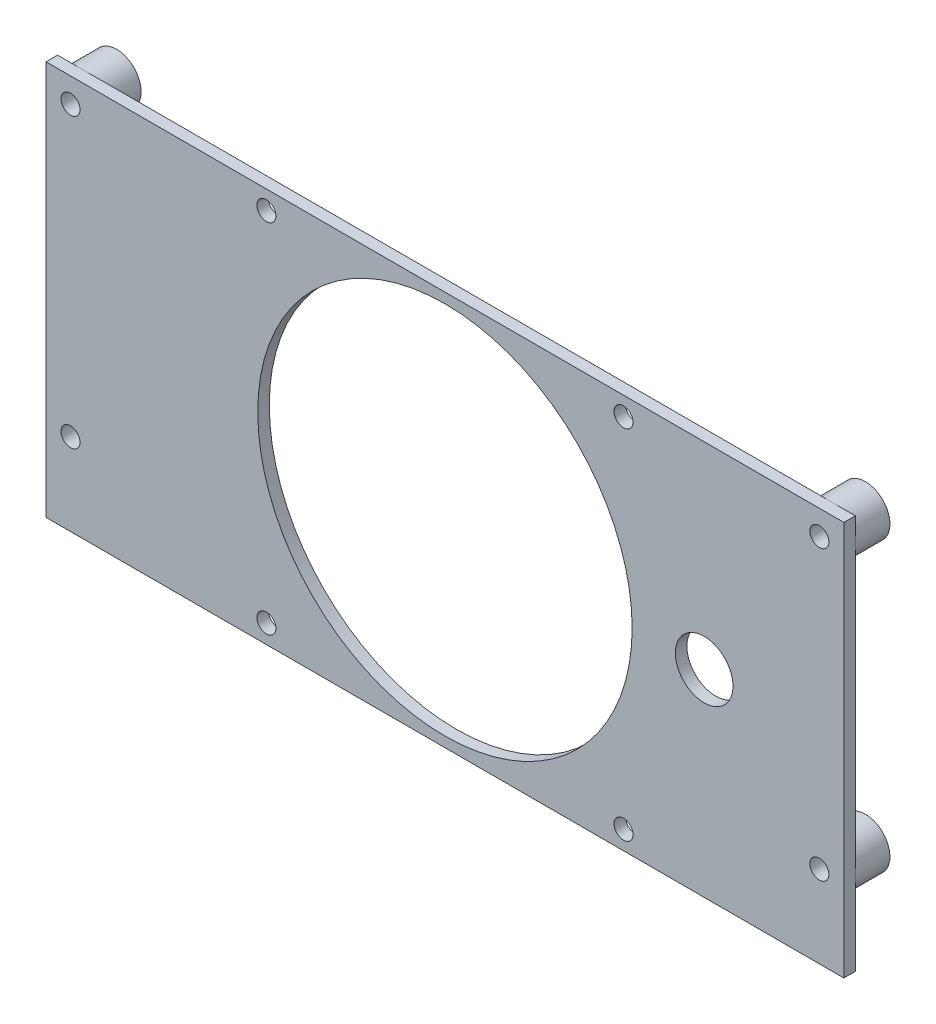
ISO-10303-21;
HEADER;
FILE_DESCRIPTION(('STEP AP214'),'2;1');
FILE_NAME('part.step','',(''),(''),'','','');
FILE_SCHEMA(('AUTOMOTIVE_DESIGN { 1 0 10303 214 1 1 1 1 }'));
ENDSEC;
DATA;
#1=APPLICATION_CONTEXT('core data for automotive mechanical design processes');
#2=APPLICATION_PROTOCOL_DEFINITION('international standard','automotive_design',2000,#1);
#3=PRODUCT_CONTEXT('',#1,'mechanical');
#4=PRODUCT('Part','Part','',(#3));
#5=PRODUCT_RELATED_PRODUCT_CATEGORY('part','',(#4));
#6=PRODUCT_DEFINITION_FORMATION('','',#4);
#7=PRODUCT_DEFINITION_CONTEXT('part definition',#1,'design');
#8=PRODUCT_DEFINITION('design','',#6,#7);
#9=PRODUCT_DEFINITION_SHAPE('','',#8);
#10=(LENGTH_UNIT() NAMED_UNIT(*) SI_UNIT(.MILLI.,.METRE.));
#11=(NAMED_UNIT(*) PLANE_ANGLE_UNIT() SI_UNIT($,.RADIAN.));
#12=(NAMED_UNIT(*) SI_UNIT($,.STERADIAN.) SOLID_ANGLE_UNIT());
#13=UNCERTAINTY_MEASURE_WITH_UNIT(LENGTH_MEASURE(1.E-05),#10,'distance_accuracy_value','');
#14=(GEOMETRIC_REPRESENTATION_CONTEXT(3) GLOBAL_UNCERTAINTY_ASSIGNED_CONTEXT((#13)) GLOBAL_UNIT_ASSIGNED_CONTEXT((#10,
#11,#12)) REPRESENTATION_CONTEXT('',''));
#15=CARTESIAN_POINT('',(0.,0.,0.));
#16=DIRECTION('',(0.,0.,1.));
#17=DIRECTION('',(1.,0.,0.));
#18=AXIS2_PLACEMENT_3D('',#15,#16,#17);
#19=CARTESIAN_POINT('',(0.,0.,0.));
#20=DIRECTION('',(0.,0.,1.));
#21=DIRECTION('',(1.,0.,0.));
#22=AXIS2_PLACEMENT_3D('',#19,#20,#21);
#23=PLANE('',#22);
#24=CARTESIAN_POINT('',(45.,0.,0.));
#25=DIRECTION('',(0.,0.,1.));
#26=DIRECTION('',(1.,0.,0.));
#27=AXIS2_PLACEMENT_3D('',#24,#25,#26);
#28=CIRCLE('',#27,5.);
#29=CARTESIAN_POINT('',(50.,0.,0.));
#30=VERTEX_POINT('',#29);
#31=EDGE_CURVE('E142',#30,#30,#28,.T.);
#32=ORIENTED_EDGE('',*,*,#31,.T.);
#33=EDGE_LOOP('',(#32));
#34=FACE_BOUND('',#33,.T.);
#35=CARTESIAN_POINT('',(31.,31.,0.));
#36=DIRECTION('',(0.,0.,1.));
#37=DIRECTION('',(-1.,0.,0.));
#38=AXIS2_PLACEMENT_3D('',#35,#36,#37);
#39=CIRCLE('',#38,1.65);
#40=CARTESIAN_POINT('',(29.35,31.,0.));
#41=VERTEX_POINT('',#40);
#42=EDGE_CURVE('E148',#41,#41,#39,.T.);
#43=ORIENTED_EDGE('',*,*,#42,.T.);
#44=EDGE_LOOP('',(#43));
#45=FACE_BOUND('',#44,.T.);
#46=CARTESIAN_POINT('',(31.,-31.,0.));
#47=DIRECTION('',(0.,0.,1.));
#48=DIRECTION('',(1.,0.,0.));
#49=AXIS2_PLACEMENT_3D('',#46,#47,#48);
#50=CIRCLE('',#49,1.65);
#51=CARTESIAN_POINT('',(32.65,-31.,0.));
#52=VERTEX_POINT('',#51);
#53=EDGE_CURVE('E154',#52,#52,#50,.T.);
#54=ORIENTED_EDGE('',*,*,#53,.T.);
#55=EDGE_LOOP('',(#54));
#56=FACE_BOUND('',#55,.T.);
#57=CARTESIAN_POINT('',(-31.,-31.,0.));
#58=DIRECTION('',(0.,0.,1.));
#59=DIRECTION('',(-1.,0.,0.));
#60=AXIS2_PLACEMENT_3D('',#57,#58,#59);
#61=CIRCLE('',#60,1.65);
#62=CARTESIAN_POINT('',(-32.65,-31.,0.));
#63=VERTEX_POINT('',#62);
#64=EDGE_CURVE('E160',#63,#63,#61,.T.);
#65=ORIENTED_EDGE('',*,*,#64,.T.);
#66=EDGE_LOOP('',(#65));
#67=FACE_BOUND('',#66,.T.);
#68=CARTESIAN_POINT('',(-31.,31.,0.));
#69=DIRECTION('',(0.,0.,1.));
#70=DIRECTION('',(1.,0.,0.));
#71=AXIS2_PLACEMENT_3D('',#68,#69,#70);
#72=CIRCLE('',#71,1.65);
#73=CARTESIAN_POINT('',(-29.35,31.,0.));
#74=VERTEX_POINT('',#73);
#75=EDGE_CURVE('E166',#74,#74,#72,.T.);
#76=ORIENTED_EDGE('',*,*,#75,.T.);
#77=EDGE_LOOP('',(#76));
#78=FACE_BOUND('',#77,.T.);
#79=CARTESIAN_POINT('',(0.,0.,0.));
#80=DIRECTION('',(0.,0.,1.));
#81=DIRECTION('',(1.,0.,0.));
#82=AXIS2_PLACEMENT_3D('',#79,#80,#81);
#83=CIRCLE('',#82,32.5);
#84=CARTESIAN_POINT('',(32.5,0.,0.));
#85=VERTEX_POINT('',#84);
#86=EDGE_CURVE('E172',#85,#85,#83,.T.);
#87=ORIENTED_EDGE('',*,*,#86,.T.);
#88=EDGE_LOOP('',(#87));
#89=FACE_BOUND('',#88,.T.);
#90=CARTESIAN_POINT('',(65.,30.,0.));
#91=DIRECTION('',(0.,0.,-1.));
#92=DIRECTION('',(1.,0.,0.));
#93=AXIS2_PLACEMENT_3D('',#90,#91,#92);
#94=CIRCLE('',#93,4.25);
#95=CARTESIAN_POINT('',(69.25,30.,0.));
#96=VERTEX_POINT('',#95);
#97=CARTESIAN_POINT('',(65.,34.25,0.));
#98=VERTEX_POINT('',#97);
#99=EDGE_CURVE('E109',#96,#98,#94,.T.);
#100=ORIENTED_EDGE('',*,*,#99,.F.);
#101=DIRECTION('',(0.,1.,0.));
#102=VECTOR('',#101,1.);
#103=CARTESIAN_POINT('',(69.25,34.25,0.));
#104=LINE('',#103,#102);
#105=CARTESIAN_POINT('',(69.25,-20.,0.));
#106=VERTEX_POINT('',#105);
#107=EDGE_CURVE('E94',#106,#96,#104,.T.);
#108=ORIENTED_EDGE('',*,*,#107,.F.);
#109=CARTESIAN_POINT('',(65.,-20.,0.));
#110=DIRECTION('',(0.,0.,-1.));
#111=DIRECTION('',(1.,0.,0.));
#112=AXIS2_PLACEMENT_3D('',#109,#110,#111);
#113=CIRCLE('',#112,4.25);
#114=EDGE_CURVE('E122',#106,#106,#113,.T.);
#115=ORIENTED_EDGE('',*,*,#114,.F.);
#116=CARTESIAN_POINT('',(69.25,-34.25,0.));
#117=VERTEX_POINT('',#116);
#118=EDGE_CURVE('E99',#117,#106,#104,.T.);
#119=ORIENTED_EDGE('',*,*,#118,.F.);
#120=DIRECTION('',(1.,0.,0.));
#121=VECTOR('',#120,1.);
#122=CARTESIAN_POINT('',(-69.25,-34.25,0.));
#123=LINE('',#122,#121);
#124=CARTESIAN_POINT('',(-69.25,-34.25,0.));
#125=VERTEX_POINT('',#124);
#126=EDGE_CURVE('E195',#125,#117,#123,.T.);
#127=ORIENTED_EDGE('',*,*,#126,.F.);
#128=DIRECTION('',(0.,-1.,0.));
#129=VECTOR('',#128,1.);
#130=CARTESIAN_POINT('',(-69.25,34.25,0.));
#131=LINE('',#130,#129);
#132=CARTESIAN_POINT('',(-69.25,-20.,0.));
#133=VERTEX_POINT('',#132);
#134=EDGE_CURVE('E204',#133,#125,#131,.T.);
#135=ORIENTED_EDGE('',*,*,#134,.F.);
#136=CARTESIAN_POINT('',(-65.,-20.,0.));
#137=DIRECTION('',(0.,0.,-1.));
#138=DIRECTION('',(-1.,0.,0.));
#139=AXIS2_PLACEMENT_3D('',#136,#137,#138);
#140=CIRCLE('',#139,4.25);
#141=EDGE_CURVE('E131',#133,#133,#140,.T.);
#142=ORIENTED_EDGE('',*,*,#141,.F.);
#143=CARTESIAN_POINT('',(-69.25,30.,0.));
#144=VERTEX_POINT('',#143);
#145=EDGE_CURVE('E207',#144,#133,#131,.T.);
#146=ORIENTED_EDGE('',*,*,#145,.F.);
#147=CARTESIAN_POINT('',(-65.,30.,0.));
#148=DIRECTION('',(0.,0.,-1.));
#149=DIRECTION('',(-1.,0.,0.));
#150=AXIS2_PLACEMENT_3D('',#147,#148,#149);
#151=CIRCLE('',#150,4.25);
#152=CARTESIAN_POINT('',(-65.,34.25,0.));
#153=VERTEX_POINT('',#152);
#154=EDGE_CURVE('E11',#153,#144,#151,.T.);
#155=ORIENTED_EDGE('',*,*,#154,.F.);
#156=DIRECTION('',(-1.,0.,0.));
#157=VECTOR('',#156,1.);
#158=CARTESIAN_POINT('',(-69.25,34.25,0.));
#159=LINE('',#158,#157);
#160=EDGE_CURVE('E56',#98,#153,#159,.T.);
#161=ORIENTED_EDGE('',*,*,#160,.F.);
#162=EDGE_LOOP('',(#100,#108,#115,#119,#127,#135,#142,#146,#155,#161));
#163=FACE_BOUND('',#162,.T.);
#164=ADVANCED_FACE('F32',(#34,#45,#56,#67,#78,#89,#163),#23,.F.);
#165=EDGE_CURVE('E49',#98,#96,#94,.T.);
#166=ORIENTED_EDGE('',*,*,#165,.F.);
#167=CARTESIAN_POINT('',(69.25,34.25,0.));
#168=VERTEX_POINT('',#167);
#169=EDGE_CURVE('E105',#168,#98,#159,.T.);
#170=ORIENTED_EDGE('',*,*,#169,.F.);
#171=EDGE_CURVE('E96',#96,#168,#104,.T.);
#172=ORIENTED_EDGE('',*,*,#171,.F.);
#173=EDGE_LOOP('',(#166,#170,#172));
#174=FACE_BOUND('',#173,.T.);
#175=ADVANCED_FACE('F104',(#174),#23,.F.);
#176=EDGE_CURVE('E42',#144,#153,#151,.T.);
#177=ORIENTED_EDGE('',*,*,#176,.F.);
#178=CARTESIAN_POINT('',(-69.25,34.25,0.));
#179=VERTEX_POINT('',#178);
#180=EDGE_CURVE('E205',#179,#144,#131,.T.);
#181=ORIENTED_EDGE('',*,*,#180,.F.);
#182=EDGE_CURVE('E202',#153,#179,#159,.T.);
#183=ORIENTED_EDGE('',*,*,#182,.F.);
#184=EDGE_LOOP('',(#177,#181,#183));
#185=FACE_BOUND('',#184,.T.);
#186=ADVANCED_FACE('F252',(#185),#23,.F.);
#187=CARTESIAN_POINT('',(0.,0.,2.));
#188=DIRECTION('',(0.,0.,1.));
#189=DIRECTION('',(1.,0.,0.));
#190=AXIS2_PLACEMENT_3D('',#187,#188,#189);
#191=PLANE('',#190);
#192=CARTESIAN_POINT('',(31.,31.,2.));
#193=DIRECTION('',(0.,0.,1.));
#194=DIRECTION('',(-1.,0.,0.));
#195=AXIS2_PLACEMENT_3D('',#192,#193,#194);
#196=CIRCLE('',#195,1.65);
#197=CARTESIAN_POINT('',(29.35,31.,2.));
#198=VERTEX_POINT('',#197);
#199=EDGE_CURVE('E151',#198,#198,#196,.T.);
#200=ORIENTED_EDGE('',*,*,#199,.F.);
#201=EDGE_LOOP('',(#200));
#202=FACE_BOUND('',#201,.T.);
#203=CARTESIAN_POINT('',(-31.,-31.,2.));
#204=DIRECTION('',(0.,0.,1.));
#205=DIRECTION('',(-1.,0.,0.));
#206=AXIS2_PLACEMENT_3D('',#203,#204,#205);
#207=CIRCLE('',#206,1.65);
#208=CARTESIAN_POINT('',(-32.65,-31.,2.));
#209=VERTEX_POINT('',#208);
#210=EDGE_CURVE('E163',#209,#209,#207,.T.);
#211=ORIENTED_EDGE('',*,*,#210,.F.);
#212=EDGE_LOOP('',(#211));
#213=FACE_BOUND('',#212,.T.);
#214=CARTESIAN_POINT('',(0.,0.,2.));
#215=DIRECTION('',(0.,0.,1.));
#216=DIRECTION('',(1.,0.,0.));
#217=AXIS2_PLACEMENT_3D('',#214,#215,#216);
#218=CIRCLE('',#217,32.5);
#219=CARTESIAN_POINT('',(32.5,0.,2.));
#220=VERTEX_POINT('',#219);
#221=EDGE_CURVE('E175',#220,#220,#218,.T.);
#222=ORIENTED_EDGE('',*,*,#221,.F.);
#223=EDGE_LOOP('',(#222));
#224=FACE_BOUND('',#223,.T.);
#225=CARTESIAN_POINT('',(65.,-20.,2.));
#226=DIRECTION('',(0.,0.,1.));
#227=DIRECTION('',(-1.,0.,0.));
#228=AXIS2_PLACEMENT_3D('',#225,#226,#227);
#229=CIRCLE('',#228,1.65);
#230=CARTESIAN_POINT('',(63.35,-20.,2.));
#231=VERTEX_POINT('',#230);
#232=EDGE_CURVE('E183',#231,#231,#229,.T.);
#233=ORIENTED_EDGE('',*,*,#232,.F.);
#234=EDGE_LOOP('',(#233));
#235=FACE_BOUND('',#234,.T.);
#236=CARTESIAN_POINT('',(-65.,30.,2.));
#237=DIRECTION('',(0.,0.,1.));
#238=DIRECTION('',(1.,0.,0.));
#239=AXIS2_PLACEMENT_3D('',#236,#237,#238);
#240=CIRCLE('',#239,1.65);
#241=CARTESIAN_POINT('',(-63.35,30.,2.));
#242=VERTEX_POINT('',#241);
#243=EDGE_CURVE('E107',#242,#242,#240,.T.);
#244=ORIENTED_EDGE('',*,*,#243,.F.);
#245=EDGE_LOOP('',(#244));
#246=FACE_BOUND('',#245,.T.);
#247=DIRECTION('',(0.,1.,0.));
#248=VECTOR('',#247,1.);
#249=CARTESIAN_POINT('',(69.25,34.25,2.));
#250=LINE('',#249,#248);
#251=CARTESIAN_POINT('',(69.25,-34.25,2.));
#252=VERTEX_POINT('',#251);
#253=CARTESIAN_POINT('',(69.25,34.25,2.));
#254=VERTEX_POINT('',#253);
#255=EDGE_CURVE('E191',#252,#254,#250,.T.);
#256=ORIENTED_EDGE('',*,*,#255,.T.);
#257=DIRECTION('',(-1.,0.,0.));
#258=VECTOR('',#257,1.);
#259=CARTESIAN_POINT('',(-69.25,34.25,2.));
#260=LINE('',#259,#258);
#261=CARTESIAN_POINT('',(-69.25,34.25,2.));
#262=VERTEX_POINT('',#261);
#263=EDGE_CURVE('E194',#254,#262,#260,.T.);
#264=ORIENTED_EDGE('',*,*,#263,.T.);
#265=DIRECTION('',(0.,-1.,0.));
#266=VECTOR('',#265,1.);
#267=CARTESIAN_POINT('',(-69.25,34.25,2.));
#268=LINE('',#267,#266);
#269=CARTESIAN_POINT('',(-69.25,-34.25,2.));
#270=VERTEX_POINT('',#269);
#271=EDGE_CURVE('E197',#262,#270,#268,.T.);
#272=ORIENTED_EDGE('',*,*,#271,.T.);
#273=DIRECTION('',(1.,0.,0.));
#274=VECTOR('',#273,1.);
#275=CARTESIAN_POINT('',(-69.25,-34.25,2.));
#276=LINE('',#275,#274);
#277=EDGE_CURVE('E199',#270,#252,#276,.T.);
#278=ORIENTED_EDGE('',*,*,#277,.T.);
#279=EDGE_LOOP('',(#256,#264,#272,#278));
#280=FACE_BOUND('',#279,.T.);
#281=CARTESIAN_POINT('',(-65.,-20.,2.));
#282=DIRECTION('',(0.,0.,1.));
#283=DIRECTION('',(1.,0.,0.));
#284=AXIS2_PLACEMENT_3D('',#281,#282,#283);
#285=CIRCLE('',#284,1.65);
#286=CARTESIAN_POINT('',(-63.35,-20.,2.));
#287=VERTEX_POINT('',#286);
#288=EDGE_CURVE('E186',#287,#287,#285,.T.);
#289=ORIENTED_EDGE('',*,*,#288,.F.);
#290=EDGE_LOOP('',(#289));
#291=FACE_BOUND('',#290,.T.);
#292=CARTESIAN_POINT('',(65.,30.,2.));
#293=DIRECTION('',(0.,0.,1.));
#294=DIRECTION('',(-1.,0.,0.));
#295=AXIS2_PLACEMENT_3D('',#292,#293,#294);
#296=CIRCLE('',#295,1.65);
#297=CARTESIAN_POINT('',(63.35,30.,2.));
#298=VERTEX_POINT('',#297);
#299=EDGE_CURVE('E178',#298,#298,#296,.T.);
#300=ORIENTED_EDGE('',*,*,#299,.F.);
#301=EDGE_LOOP('',(#300));
#302=FACE_BOUND('',#301,.T.);
#303=CARTESIAN_POINT('',(-31.,31.,2.));
#304=DIRECTION('',(0.,0.,1.));
#305=DIRECTION('',(1.,0.,0.));
#306=AXIS2_PLACEMENT_3D('',#303,#304,#305);
#307=CIRCLE('',#306,1.65);
#308=CARTESIAN_POINT('',(-29.35,31.,2.));
#309=VERTEX_POINT('',#308);
#310=EDGE_CURVE('E169',#309,#309,#307,.T.);
#311=ORIENTED_EDGE('',*,*,#310,.F.);
#312=EDGE_LOOP('',(#311));
#313=FACE_BOUND('',#312,.T.);
#314=CARTESIAN_POINT('',(31.,-31.,2.));
#315=DIRECTION('',(0.,0.,1.));
#316=DIRECTION('',(1.,0.,0.));
#317=AXIS2_PLACEMENT_3D('',#314,#315,#316);
#318=CIRCLE('',#317,1.65);
#319=CARTESIAN_POINT('',(32.65,-31.,2.));
#320=VERTEX_POINT('',#319);
#321=EDGE_CURVE('E157',#320,#320,#318,.T.);
#322=ORIENTED_EDGE('',*,*,#321,.F.);
#323=EDGE_LOOP('',(#322));
#324=FACE_BOUND('',#323,.T.);
#325=CARTESIAN_POINT('',(45.,0.,2.));
#326=DIRECTION('',(0.,0.,1.));
#327=DIRECTION('',(1.,0.,0.));
#328=AXIS2_PLACEMENT_3D('',#325,#326,#327);
#329=CIRCLE('',#328,5.);
#330=CARTESIAN_POINT('',(50.,0.,2.));
#331=VERTEX_POINT('',#330);
#332=EDGE_CURVE('E145',#331,#331,#329,.T.);
#333=ORIENTED_EDGE('',*,*,#332,.F.);
#334=EDGE_LOOP('',(#333));
#335=FACE_BOUND('',#334,.T.);
#336=ADVANCED_FACE('F222',(#202,#213,#224,#235,#246,#280,#291,#302,#313,#324,#335),#191,.T.);
#337=CARTESIAN_POINT('',(69.25,34.25,2.));
#338=DIRECTION('',(-1.,0.,0.));
#339=DIRECTION('',(0.,0.,1.));
#340=AXIS2_PLACEMENT_3D('',#337,#338,#339);
#341=PLANE('',#340);
#342=ORIENTED_EDGE('',*,*,#118,.T.);
#343=ORIENTED_EDGE('',*,*,#107,.T.);
#344=ORIENTED_EDGE('',*,*,#171,.T.);
#345=DIRECTION('',(0.,0.,-1.));
#346=VECTOR('',#345,1.);
#347=CARTESIAN_POINT('',(69.25,34.25,2.));
#348=LINE('',#347,#346);
#349=EDGE_CURVE('E36',#254,#168,#348,.T.);
#350=ORIENTED_EDGE('',*,*,#349,.F.);
#351=ORIENTED_EDGE('',*,*,#255,.F.);
#352=DIRECTION('',(0.,0.,-1.));
#353=VECTOR('',#352,1.);
#354=CARTESIAN_POINT('',(69.25,-34.25,2.));
#355=LINE('',#354,#353);
#356=EDGE_CURVE('E200',#252,#117,#355,.T.);
#357=ORIENTED_EDGE('',*,*,#356,.T.);
#358=EDGE_LOOP('',(#342,#343,#344,#350,#351,#357));
#359=FACE_BOUND('',#358,.T.);
#360=ADVANCED_FACE('F34',(#359),#341,.F.);
#361=CARTESIAN_POINT('',(-69.25,34.25,2.));
#362=DIRECTION('',(0.,-1.,0.));
#363=DIRECTION('',(0.,0.,-1.));
#364=AXIS2_PLACEMENT_3D('',#361,#362,#363);
#365=PLANE('',#364);
#366=ORIENTED_EDGE('',*,*,#169,.T.);
#367=ORIENTED_EDGE('',*,*,#160,.T.);
#368=ORIENTED_EDGE('',*,*,#182,.T.);
#369=DIRECTION('',(0.,0.,-1.));
#370=VECTOR('',#369,1.);
#371=CARTESIAN_POINT('',(-69.25,34.25,2.));
#372=LINE('',#371,#370);
#373=EDGE_CURVE('E212',#262,#179,#372,.T.);
#374=ORIENTED_EDGE('',*,*,#373,.F.);
#375=ORIENTED_EDGE('',*,*,#263,.F.);
#376=ORIENTED_EDGE('',*,*,#349,.T.);
#377=EDGE_LOOP('',(#366,#367,#368,#374,#375,#376));
#378=FACE_BOUND('',#377,.T.);
#379=ADVANCED_FACE('F218',(#378),#365,.F.);
#380=CARTESIAN_POINT('',(-69.25,34.25,2.));
#381=DIRECTION('',(1.,0.,0.));
#382=DIRECTION('',(0.,1.,0.));
#383=AXIS2_PLACEMENT_3D('',#380,#381,#382);
#384=PLANE('',#383);
#385=ORIENTED_EDGE('',*,*,#180,.T.);
#386=ORIENTED_EDGE('',*,*,#145,.T.);
#387=ORIENTED_EDGE('',*,*,#134,.T.);
#388=DIRECTION('',(0.,0.,-1.));
#389=VECTOR('',#388,1.);
#390=CARTESIAN_POINT('',(-69.25,-34.25,2.));
#391=LINE('',#390,#389);
#392=EDGE_CURVE('E210',#270,#125,#391,.T.);
#393=ORIENTED_EDGE('',*,*,#392,.F.);
#394=ORIENTED_EDGE('',*,*,#271,.F.);
#395=ORIENTED_EDGE('',*,*,#373,.T.);
#396=EDGE_LOOP('',(#385,#386,#387,#393,#394,#395));
#397=FACE_BOUND('',#396,.T.);
#398=ADVANCED_FACE('F270',(#397),#384,.F.);
#399=CARTESIAN_POINT('',(-69.25,-34.25,2.));
#400=DIRECTION('',(0.,1.,0.));
#401=DIRECTION('',(0.,0.,1.));
#402=AXIS2_PLACEMENT_3D('',#399,#400,#401);
#403=PLANE('',#402);
#404=ORIENTED_EDGE('',*,*,#126,.T.);
#405=ORIENTED_EDGE('',*,*,#356,.F.);
#406=ORIENTED_EDGE('',*,*,#277,.F.);
#407=ORIENTED_EDGE('',*,*,#392,.T.);
#408=EDGE_LOOP('',(#404,#405,#406,#407));
#409=FACE_BOUND('',#408,.T.);
#410=ADVANCED_FACE('F227',(#409),#403,.F.);
#411=CARTESIAN_POINT('',(-65.,30.,2.));
#412=DIRECTION('',(0.,0.,-1.));
#413=DIRECTION('',(-1.,0.,0.));
#414=AXIS2_PLACEMENT_3D('',#411,#412,#413);
#415=CYLINDRICAL_SURFACE('',#414,1.65);
#416=ORIENTED_EDGE('',*,*,#243,.T.);
#417=EDGE_LOOP('',(#416));
#418=FACE_BOUND('',#417,.T.);
#419=CARTESIAN_POINT('',(-65.,30.,-6.));
#420=DIRECTION('',(0.,0.,-1.));
#421=DIRECTION('',(-1.,0.,0.));
#422=AXIS2_PLACEMENT_3D('',#419,#420,#421);
#423=CIRCLE('',#422,1.65);
#424=CARTESIAN_POINT('',(-66.65,30.,-6.));
#425=VERTEX_POINT('',#424);
#426=EDGE_CURVE('E135',#425,#425,#423,.T.);
#427=ORIENTED_EDGE('',*,*,#426,.T.);
#428=EDGE_LOOP('',(#427));
#429=FACE_BOUND('',#428,.T.);
#430=ADVANCED_FACE('F277',(#418,#429),#415,.F.);
#431=CARTESIAN_POINT('',(-65.,-20.,2.));
#432=DIRECTION('',(0.,0.,-1.));
#433=DIRECTION('',(-1.,0.,0.));
#434=AXIS2_PLACEMENT_3D('',#431,#432,#433);
#435=CYLINDRICAL_SURFACE('',#434,1.65);
#436=ORIENTED_EDGE('',*,*,#288,.T.);
#437=EDGE_LOOP('',(#436));
#438=FACE_BOUND('',#437,.T.);
#439=CARTESIAN_POINT('',(-65.,-20.,-6.));
#440=DIRECTION('',(0.,0.,-1.));
#441=DIRECTION('',(-1.,0.,0.));
#442=AXIS2_PLACEMENT_3D('',#439,#440,#441);
#443=CIRCLE('',#442,1.65);
#444=CARTESIAN_POINT('',(-66.65,-20.,-6.));
#445=VERTEX_POINT('',#444);
#446=EDGE_CURVE('E126',#445,#445,#443,.T.);
#447=ORIENTED_EDGE('',*,*,#446,.T.);
#448=EDGE_LOOP('',(#447));
#449=FACE_BOUND('',#448,.T.);
#450=ADVANCED_FACE('F384',(#438,#449),#435,.F.);
#451=CARTESIAN_POINT('',(65.,-20.,2.));
#452=DIRECTION('',(0.,0.,-1.));
#453=DIRECTION('',(-1.,0.,0.));
#454=AXIS2_PLACEMENT_3D('',#451,#452,#453);
#455=CYLINDRICAL_SURFACE('',#454,1.65);
#456=ORIENTED_EDGE('',*,*,#232,.T.);
#457=EDGE_LOOP('',(#456));
#458=FACE_BOUND('',#457,.T.);
#459=CARTESIAN_POINT('',(65.,-20.,-6.));
#460=DIRECTION('',(0.,0.,-1.));
#461=DIRECTION('',(1.,0.,0.));
#462=AXIS2_PLACEMENT_3D('',#459,#460,#461);
#463=CIRCLE('',#462,1.65);
#464=CARTESIAN_POINT('',(66.65,-20.,-6.));
#465=VERTEX_POINT('',#464);
#466=EDGE_CURVE('E119',#465,#465,#463,.T.);
#467=ORIENTED_EDGE('',*,*,#466,.T.);
#468=EDGE_LOOP('',(#467));
#469=FACE_BOUND('',#468,.T.);
#470=ADVANCED_FACE('F396',(#458,#469),#455,.F.);
#471=CARTESIAN_POINT('',(65.,30.,2.));
#472=DIRECTION('',(0.,0.,-1.));
#473=DIRECTION('',(-1.,0.,0.));
#474=AXIS2_PLACEMENT_3D('',#471,#472,#473);
#475=CYLINDRICAL_SURFACE('',#474,1.65);
#476=ORIENTED_EDGE('',*,*,#299,.T.);
#477=EDGE_LOOP('',(#476));
#478=FACE_BOUND('',#477,.T.);
#479=CARTESIAN_POINT('',(65.,30.,-6.));
#480=DIRECTION('',(0.,0.,-1.));
#481=DIRECTION('',(1.,0.,0.));
#482=AXIS2_PLACEMENT_3D('',#479,#480,#481);
#483=CIRCLE('',#482,1.65);
#484=CARTESIAN_POINT('',(66.65,30.,-6.));
#485=VERTEX_POINT('',#484);
#486=EDGE_CURVE('E114',#485,#485,#483,.T.);
#487=ORIENTED_EDGE('',*,*,#486,.T.);
#488=EDGE_LOOP('',(#487));
#489=FACE_BOUND('',#488,.T.);
#490=ADVANCED_FACE('F307',(#478,#489),#475,.F.);
#491=CARTESIAN_POINT('',(0.,0.,2.));
#492=DIRECTION('',(0.,0.,-1.));
#493=DIRECTION('',(-1.,0.,0.));
#494=AXIS2_PLACEMENT_3D('',#491,#492,#493);
#495=CYLINDRICAL_SURFACE('',#494,32.5);
#496=ORIENTED_EDGE('',*,*,#221,.T.);
#497=EDGE_LOOP('',(#496));
#498=FACE_BOUND('',#497,.T.);
#499=ORIENTED_EDGE('',*,*,#86,.F.);
#500=EDGE_LOOP('',(#499));
#501=FACE_BOUND('',#500,.T.);
#502=ADVANCED_FACE('F301',(#498,#501),#495,.F.);
#503=CARTESIAN_POINT('',(-31.,31.,2.));
#504=DIRECTION('',(0.,0.,-1.));
#505=DIRECTION('',(-1.,0.,0.));
#506=AXIS2_PLACEMENT_3D('',#503,#504,#505);
#507=CYLINDRICAL_SURFACE('',#506,1.65);
#508=ORIENTED_EDGE('',*,*,#310,.T.);
#509=EDGE_LOOP('',(#508));
#510=FACE_BOUND('',#509,.T.);
#511=ORIENTED_EDGE('',*,*,#75,.F.);
#512=EDGE_LOOP('',(#511));
#513=FACE_BOUND('',#512,.T.);
#514=ADVANCED_FACE('F306',(#510,#513),#507,.F.);
#515=CARTESIAN_POINT('',(-31.,-31.,2.));
#516=DIRECTION('',(0.,0.,-1.));
#517=DIRECTION('',(-1.,0.,0.));
#518=AXIS2_PLACEMENT_3D('',#515,#516,#517);
#519=CYLINDRICAL_SURFACE('',#518,1.65);
#520=ORIENTED_EDGE('',*,*,#210,.T.);
#521=EDGE_LOOP('',(#520));
#522=FACE_BOUND('',#521,.T.);
#523=ORIENTED_EDGE('',*,*,#64,.F.);
#524=EDGE_LOOP('',(#523));
#525=FACE_BOUND('',#524,.T.);
#526=ADVANCED_FACE('F319',(#522,#525),#519,.F.);
#527=CARTESIAN_POINT('',(31.,-31.,2.));
#528=DIRECTION('',(0.,0.,-1.));
#529=DIRECTION('',(-1.,0.,0.));
#530=AXIS2_PLACEMENT_3D('',#527,#528,#529);
#531=CYLINDRICAL_SURFACE('',#530,1.65);
#532=ORIENTED_EDGE('',*,*,#321,.T.);
#533=EDGE_LOOP('',(#532));
#534=FACE_BOUND('',#533,.T.);
#535=ORIENTED_EDGE('',*,*,#53,.F.);
#536=EDGE_LOOP('',(#535));
#537=FACE_BOUND('',#536,.T.);
#538=ADVANCED_FACE('F329',(#534,#537),#531,.F.);
#539=CARTESIAN_POINT('',(31.,31.,2.));
#540=DIRECTION('',(0.,0.,-1.));
#541=DIRECTION('',(-1.,0.,0.));
#542=AXIS2_PLACEMENT_3D('',#539,#540,#541);
#543=CYLINDRICAL_SURFACE('',#542,1.65);
#544=ORIENTED_EDGE('',*,*,#199,.T.);
#545=EDGE_LOOP('',(#544));
#546=FACE_BOUND('',#545,.T.);
#547=ORIENTED_EDGE('',*,*,#42,.F.);
#548=EDGE_LOOP('',(#547));
#549=FACE_BOUND('',#548,.T.);
#550=ADVANCED_FACE('F339',(#546,#549),#543,.F.);
#551=CARTESIAN_POINT('',(45.,0.,2.));
#552=DIRECTION('',(0.,0.,-1.));
#553=DIRECTION('',(-1.,0.,0.));
#554=AXIS2_PLACEMENT_3D('',#551,#552,#553);
#555=CYLINDRICAL_SURFACE('',#554,5.);
#556=ORIENTED_EDGE('',*,*,#332,.T.);
#557=EDGE_LOOP('',(#556));
#558=FACE_BOUND('',#557,.T.);
#559=ORIENTED_EDGE('',*,*,#31,.F.);
#560=EDGE_LOOP('',(#559));
#561=FACE_BOUND('',#560,.T.);
#562=ADVANCED_FACE('F349',(#558,#561),#555,.F.);
#563=CARTESIAN_POINT('',(-65.,30.,-6.));
#564=DIRECTION('',(0.,0.,-1.));
#565=DIRECTION('',(-1.,0.,0.));
#566=AXIS2_PLACEMENT_3D('',#563,#564,#565);
#567=PLANE('',#566);
#568=CARTESIAN_POINT('',(-65.,30.,-6.));
#569=DIRECTION('',(0.,0.,-1.));
#570=DIRECTION('',(-1.,0.,0.));
#571=AXIS2_PLACEMENT_3D('',#568,#569,#570);
#572=CIRCLE('',#571,4.25);
#573=CARTESIAN_POINT('',(-69.25,30.,-6.));
#574=VERTEX_POINT('',#573);
#575=EDGE_CURVE('E140',#574,#574,#572,.T.);
#576=ORIENTED_EDGE('',*,*,#575,.T.);
#577=EDGE_LOOP('',(#576));
#578=FACE_BOUND('',#577,.T.);
#579=ORIENTED_EDGE('',*,*,#426,.F.);
#580=EDGE_LOOP('',(#579));
#581=FACE_BOUND('',#580,.T.);
#582=ADVANCED_FACE('F358',(#578,#581),#567,.T.);
#583=CARTESIAN_POINT('',(-65.,30.,-6.));
#584=DIRECTION('',(0.,0.,1.));
#585=DIRECTION('',(1.,0.,0.));
#586=AXIS2_PLACEMENT_3D('',#583,#584,#585);
#587=CYLINDRICAL_SURFACE('',#586,4.25);
#588=ORIENTED_EDGE('',*,*,#575,.F.);
#589=EDGE_LOOP('',(#588));
#590=FACE_BOUND('',#589,.T.);
#591=ORIENTED_EDGE('',*,*,#176,.T.);
#592=ORIENTED_EDGE('',*,*,#154,.T.);
#593=EDGE_LOOP('',(#591,#592));
#594=FACE_BOUND('',#593,.T.);
#595=ADVANCED_FACE('F268',(#590,#594),#587,.T.);
#596=CARTESIAN_POINT('',(-65.,-20.,-6.));
#597=DIRECTION('',(0.,0.,-1.));
#598=DIRECTION('',(-1.,0.,0.));
#599=AXIS2_PLACEMENT_3D('',#596,#597,#598);
#600=PLANE('',#599);
#601=CARTESIAN_POINT('',(-65.,-20.,-6.));
#602=DIRECTION('',(0.,0.,-1.));
#603=DIRECTION('',(-1.,0.,0.));
#604=AXIS2_PLACEMENT_3D('',#601,#602,#603);
#605=CIRCLE('',#604,4.25);
#606=CARTESIAN_POINT('',(-69.25,-20.,-6.));
#607=VERTEX_POINT('',#606);
#608=EDGE_CURVE('E132',#607,#607,#605,.T.);
#609=ORIENTED_EDGE('',*,*,#608,.T.);
#610=EDGE_LOOP('',(#609));
#611=FACE_BOUND('',#610,.T.);
#612=ORIENTED_EDGE('',*,*,#446,.F.);
#613=EDGE_LOOP('',(#612));
#614=FACE_BOUND('',#613,.T.);
#615=ADVANCED_FACE('F434',(#611,#614),#600,.T.);
#616=CARTESIAN_POINT('',(-65.,-20.,-6.));
#617=DIRECTION('',(0.,0.,1.));
#618=DIRECTION('',(1.,0.,0.));
#619=AXIS2_PLACEMENT_3D('',#616,#617,#618);
#620=CYLINDRICAL_SURFACE('',#619,4.25);
#621=ORIENTED_EDGE('',*,*,#608,.F.);
#622=EDGE_LOOP('',(#621));
#623=FACE_BOUND('',#622,.T.);
#624=ORIENTED_EDGE('',*,*,#141,.T.);
#625=EDGE_LOOP('',(#624));
#626=FACE_BOUND('',#625,.T.);
#627=ADVANCED_FACE('F244',(#623,#626),#620,.T.);
#628=CARTESIAN_POINT('',(65.,-20.,-6.));
#629=DIRECTION('',(0.,0.,1.));
#630=DIRECTION('',(1.,0.,0.));
#631=AXIS2_PLACEMENT_3D('',#628,#629,#630);
#632=PLANE('',#631);
#633=CARTESIAN_POINT('',(65.,-20.,-6.));
#634=DIRECTION('',(0.,0.,-1.));
#635=DIRECTION('',(1.,0.,0.));
#636=AXIS2_PLACEMENT_3D('',#633,#634,#635);
#637=CIRCLE('',#636,4.25);
#638=CARTESIAN_POINT('',(69.25,-20.,-6.));
#639=VERTEX_POINT('',#638);
#640=EDGE_CURVE('E123',#639,#639,#637,.T.);
#641=ORIENTED_EDGE('',*,*,#640,.T.);
#642=EDGE_LOOP('',(#641));
#643=FACE_BOUND('',#642,.T.);
#644=ORIENTED_EDGE('',*,*,#466,.F.);
#645=EDGE_LOOP('',(#644));
#646=FACE_BOUND('',#645,.T.);
#647=ADVANCED_FACE('F235',(#643,#646),#632,.F.);
#648=CARTESIAN_POINT('',(65.,-20.,-6.));
#649=DIRECTION('',(0.,0.,1.));
#650=DIRECTION('',(1.,0.,0.));
#651=AXIS2_PLACEMENT_3D('',#648,#649,#650);
#652=CYLINDRICAL_SURFACE('',#651,4.25);
#653=ORIENTED_EDGE('',*,*,#640,.F.);
#654=EDGE_LOOP('',(#653));
#655=FACE_BOUND('',#654,.T.);
#656=ORIENTED_EDGE('',*,*,#114,.T.);
#657=EDGE_LOOP('',(#656));
#658=FACE_BOUND('',#657,.T.);
#659=ADVANCED_FACE('F232',(#655,#658),#652,.T.);
#660=CARTESIAN_POINT('',(65.,30.,-6.));
#661=DIRECTION('',(0.,0.,1.));
#662=DIRECTION('',(1.,0.,0.));
#663=AXIS2_PLACEMENT_3D('',#660,#661,#662);
#664=PLANE('',#663);
#665=CARTESIAN_POINT('',(65.,30.,-6.));
#666=DIRECTION('',(0.,0.,-1.));
#667=DIRECTION('',(1.,0.,0.));
#668=AXIS2_PLACEMENT_3D('',#665,#666,#667);
#669=CIRCLE('',#668,4.25);
#670=CARTESIAN_POINT('',(69.25,30.,-6.));
#671=VERTEX_POINT('',#670);
#672=EDGE_CURVE('E111',#671,#671,#669,.T.);
#673=ORIENTED_EDGE('',*,*,#672,.T.);
#674=EDGE_LOOP('',(#673));
#675=FACE_BOUND('',#674,.T.);
#676=ORIENTED_EDGE('',*,*,#486,.F.);
#677=EDGE_LOOP('',(#676));
#678=FACE_BOUND('',#677,.T.);
#679=ADVANCED_FACE('F234',(#675,#678),#664,.F.);
#680=CARTESIAN_POINT('',(65.,30.,-6.));
#681=DIRECTION('',(0.,0.,1.));
#682=DIRECTION('',(1.,0.,0.));
#683=AXIS2_PLACEMENT_3D('',#680,#681,#682);
#684=CYLINDRICAL_SURFACE('',#683,4.25);
#685=ORIENTED_EDGE('',*,*,#672,.F.);
#686=EDGE_LOOP('',(#685));
#687=FACE_BOUND('',#686,.T.);
#688=ORIENTED_EDGE('',*,*,#99,.T.);
#689=ORIENTED_EDGE('',*,*,#165,.T.);
#690=EDGE_LOOP('',(#688,#689));
#691=FACE_BOUND('',#690,.T.);
#692=ADVANCED_FACE('F113',(#687,#691),#684,.T.);
#693=CLOSED_SHELL('',(#164,#175,#186,#336,#360,#379,#398,#410,#430,#450,#470,#490,#502,#514,
#526,#538,#550,#562,#582,#595,#615,#627,#647,#659,#679,#692));
#694=MANIFOLD_SOLID_BREP('B2',#693);
#695=ADVANCED_BREP_SHAPE_REPRESENTATION('',(#18,#694),#14);
#696=SHAPE_DEFINITION_REPRESENTATION(#9,#695);
ENDSEC;
END-ISO-10303-21;
